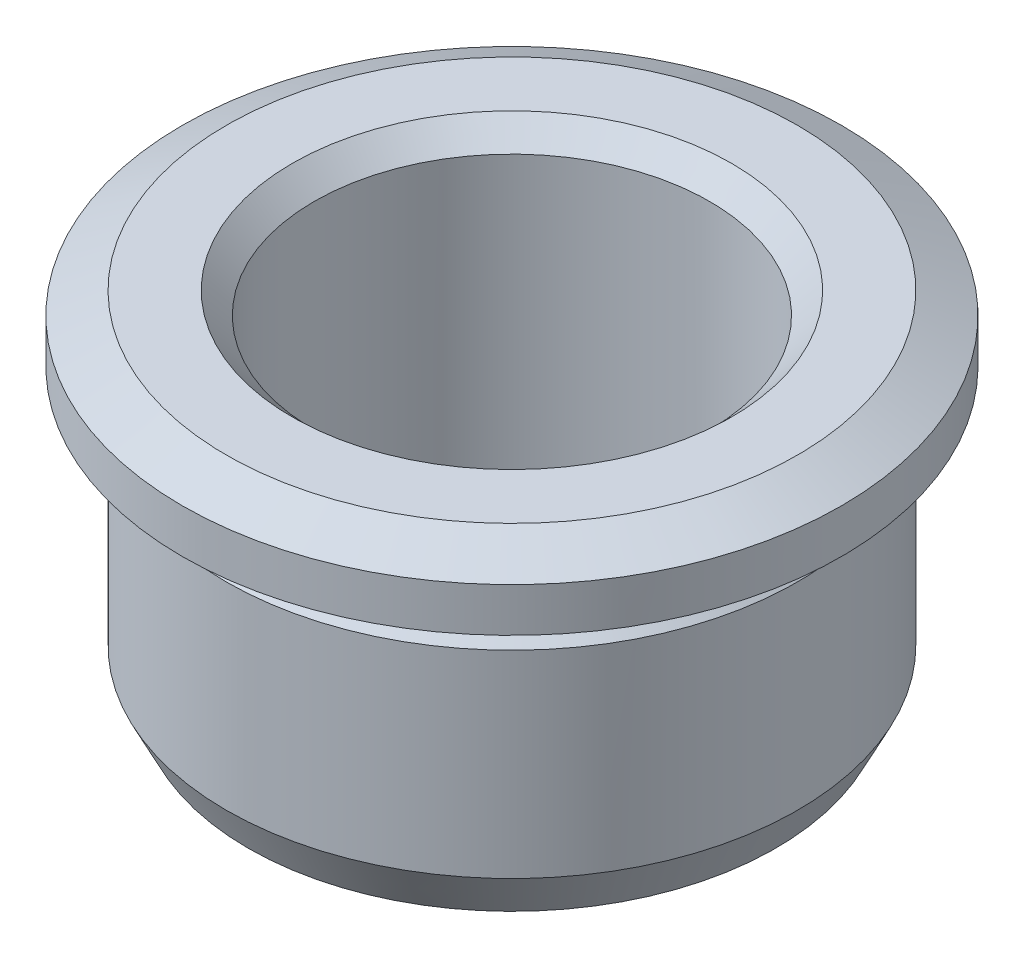
ISO-10303-21;
HEADER;
FILE_DESCRIPTION(('STEP AP214'),'2;1');
FILE_NAME('part.step','',(''),(''),'','','');
FILE_SCHEMA(('AUTOMOTIVE_DESIGN { 1 0 10303 214 1 1 1 1 }'));
ENDSEC;
DATA;
#1=APPLICATION_CONTEXT('core data for automotive mechanical design processes');
#2=APPLICATION_PROTOCOL_DEFINITION('international standard','automotive_design',2000,#1);
#3=PRODUCT_CONTEXT('',#1,'mechanical');
#4=PRODUCT('Part','Part','',(#3));
#5=PRODUCT_RELATED_PRODUCT_CATEGORY('part','',(#4));
#6=PRODUCT_DEFINITION_FORMATION('','',#4);
#7=PRODUCT_DEFINITION_CONTEXT('part definition',#1,'design');
#8=PRODUCT_DEFINITION('design','',#6,#7);
#9=PRODUCT_DEFINITION_SHAPE('','',#8);
#10=(LENGTH_UNIT() NAMED_UNIT(*) SI_UNIT(.MILLI.,.METRE.));
#11=(NAMED_UNIT(*) PLANE_ANGLE_UNIT() SI_UNIT($,.RADIAN.));
#12=(NAMED_UNIT(*) SI_UNIT($,.STERADIAN.) SOLID_ANGLE_UNIT());
#13=UNCERTAINTY_MEASURE_WITH_UNIT(LENGTH_MEASURE(1.E-05),#10,'distance_accuracy_value','');
#14=(GEOMETRIC_REPRESENTATION_CONTEXT(3) GLOBAL_UNCERTAINTY_ASSIGNED_CONTEXT((#13)) GLOBAL_UNIT_ASSIGNED_CONTEXT((#10,
#11,#12)) REPRESENTATION_CONTEXT('',''));
#15=CARTESIAN_POINT('',(0.,0.,0.));
#16=DIRECTION('',(0.,0.,1.));
#17=DIRECTION('',(1.,0.,0.));
#18=AXIS2_PLACEMENT_3D('',#15,#16,#17);
#19=CARTESIAN_POINT('',(0.,0.,0.));
#20=DIRECTION('',(0.,1.,0.));
#21=DIRECTION('',(0.,0.,1.));
#22=AXIS2_PLACEMENT_3D('',#19,#20,#21);
#23=PLANE('',#22);
#24=CARTESIAN_POINT('',(0.,0.,0.));
#25=DIRECTION('',(0.,1.,0.));
#26=DIRECTION('',(0.,0.,1.));
#27=AXIS2_PLACEMENT_3D('',#24,#25,#26);
#28=CIRCLE('',#27,10.);
#29=CARTESIAN_POINT('',(0.,0.,10.));
#30=VERTEX_POINT('',#29);
#31=EDGE_CURVE('E39',#30,#30,#28,.T.);
#32=ORIENTED_EDGE('',*,*,#31,.T.);
#33=EDGE_LOOP('',(#32));
#34=FACE_BOUND('',#33,.T.);
#35=CARTESIAN_POINT('',(0.,0.,0.));
#36=DIRECTION('',(0.,1.,0.));
#37=DIRECTION('',(0.,0.,1.));
#38=AXIS2_PLACEMENT_3D('',#35,#36,#37);
#39=CIRCLE('',#38,12.);
#40=CARTESIAN_POINT('',(0.,0.,12.));
#41=VERTEX_POINT('',#40);
#42=EDGE_CURVE('E61',#41,#41,#39,.F.);
#43=ORIENTED_EDGE('',*,*,#42,.T.);
#44=EDGE_LOOP('',(#43));
#45=FACE_BOUND('',#44,.T.);
#46=ADVANCED_FACE('F32',(#34,#45),#23,.F.);
#47=CARTESIAN_POINT('',(0.,16.,0.));
#48=DIRECTION('',(0.,1.,0.));
#49=DIRECTION('',(0.,0.,1.));
#50=AXIS2_PLACEMENT_3D('',#47,#48,#49);
#51=CYLINDRICAL_SURFACE('',#50,13.);
#52=CARTESIAN_POINT('',(0.,11.,0.));
#53=DIRECTION('',(0.,-1.,0.));
#54=DIRECTION('',(0.,0.,-1.));
#55=AXIS2_PLACEMENT_3D('',#52,#53,#54);
#56=CIRCLE('',#55,13.);
#57=CARTESIAN_POINT('',(0.,11.,-13.));
#58=VERTEX_POINT('',#57);
#59=EDGE_CURVE('E10',#58,#58,#56,.T.);
#60=ORIENTED_EDGE('',*,*,#59,.T.);
#61=EDGE_LOOP('',(#60));
#62=FACE_BOUND('',#61,.T.);
#63=CARTESIAN_POINT('',(0.,2.00000000000003,0.));
#64=DIRECTION('',(0.,1.,0.));
#65=DIRECTION('',(0.,0.,1.));
#66=AXIS2_PLACEMENT_3D('',#63,#64,#65);
#67=CIRCLE('',#66,13.);
#68=CARTESIAN_POINT('',(0.,2.00000000000003,13.));
#69=VERTEX_POINT('',#68);
#70=EDGE_CURVE('E64',#69,#69,#67,.T.);
#71=ORIENTED_EDGE('',*,*,#70,.T.);
#72=EDGE_LOOP('',(#71));
#73=FACE_BOUND('',#72,.T.);
#74=ADVANCED_FACE('F88',(#62,#73),#51,.T.);
#75=CARTESIAN_POINT('',(0.,16.,0.));
#76=DIRECTION('',(0.,1.,0.));
#77=DIRECTION('',(0.,0.,1.));
#78=AXIS2_PLACEMENT_3D('',#75,#76,#77);
#79=CYLINDRICAL_SURFACE('',#78,12.);
#80=CARTESIAN_POINT('',(0.,13.,0.));
#81=DIRECTION('',(0.,1.,0.));
#82=DIRECTION('',(0.,0.,1.));
#83=AXIS2_PLACEMENT_3D('',#80,#81,#82);
#84=CIRCLE('',#83,12.);
#85=CARTESIAN_POINT('',(0.,13.,12.));
#86=VERTEX_POINT('',#85);
#87=EDGE_CURVE('E70',#86,#86,#84,.T.);
#88=ORIENTED_EDGE('',*,*,#87,.F.);
#89=EDGE_LOOP('',(#88));
#90=FACE_BOUND('',#89,.T.);
#91=CARTESIAN_POINT('',(0.,12.,0.));
#92=DIRECTION('',(0.,1.,0.));
#93=DIRECTION('',(0.,0.,1.));
#94=AXIS2_PLACEMENT_3D('',#91,#92,#93);
#95=CIRCLE('',#94,12.);
#96=CARTESIAN_POINT('',(0.,12.,12.));
#97=VERTEX_POINT('',#96);
#98=EDGE_CURVE('E67',#97,#97,#95,.T.);
#99=ORIENTED_EDGE('',*,*,#98,.T.);
#100=EDGE_LOOP('',(#99));
#101=FACE_BOUND('',#100,.T.);
#102=ADVANCED_FACE('F82',(#90,#101),#79,.T.);
#103=CARTESIAN_POINT('',(12.,13.,0.));
#104=DIRECTION('',(0.,1.,0.));
#105=DIRECTION('',(0.,0.,1.));
#106=AXIS2_PLACEMENT_3D('',#103,#104,#105);
#107=PLANE('',#106);
#108=CARTESIAN_POINT('',(0.,13.,0.));
#109=DIRECTION('',(0.,1.,0.));
#110=DIRECTION('',(0.,0.,1.));
#111=AXIS2_PLACEMENT_3D('',#108,#109,#110);
#112=CIRCLE('',#111,15.);
#113=CARTESIAN_POINT('',(0.,13.,15.));
#114=VERTEX_POINT('',#113);
#115=EDGE_CURVE('E73',#114,#114,#112,.T.);
#116=ORIENTED_EDGE('',*,*,#115,.F.);
#117=EDGE_LOOP('',(#116));
#118=FACE_BOUND('',#117,.T.);
#119=ORIENTED_EDGE('',*,*,#87,.T.);
#120=EDGE_LOOP('',(#119));
#121=FACE_BOUND('',#120,.T.);
#122=ADVANCED_FACE('F79',(#118,#121),#107,.F.);
#123=CARTESIAN_POINT('',(0.,16.,0.));
#124=DIRECTION('',(0.,1.,0.));
#125=DIRECTION('',(0.,0.,1.));
#126=AXIS2_PLACEMENT_3D('',#123,#124,#125);
#127=CYLINDRICAL_SURFACE('',#126,15.);
#128=CARTESIAN_POINT('',(0.,15.,0.));
#129=DIRECTION('',(0.,-1.,0.));
#130=DIRECTION('',(0.,0.,-1.));
#131=AXIS2_PLACEMENT_3D('',#128,#129,#130);
#132=CIRCLE('',#131,15.);
#133=CARTESIAN_POINT('',(0.,15.,-15.));
#134=VERTEX_POINT('',#133);
#135=EDGE_CURVE('E55',#134,#134,#132,.T.);
#136=ORIENTED_EDGE('',*,*,#135,.T.);
#137=EDGE_LOOP('',(#136));
#138=FACE_BOUND('',#137,.T.);
#139=ORIENTED_EDGE('',*,*,#115,.T.);
#140=EDGE_LOOP('',(#139));
#141=FACE_BOUND('',#140,.T.);
#142=ADVANCED_FACE('F77',(#138,#141),#127,.T.);
#143=CARTESIAN_POINT('',(15.,16.,0.));
#144=DIRECTION('',(0.,-1.,0.));
#145=DIRECTION('',(0.,0.,-1.));
#146=AXIS2_PLACEMENT_3D('',#143,#144,#145);
#147=PLANE('',#146);
#148=CARTESIAN_POINT('',(0.,16.,0.));
#149=DIRECTION('',(0.,-1.,0.));
#150=DIRECTION('',(0.,0.,-1.));
#151=AXIS2_PLACEMENT_3D('',#148,#149,#150);
#152=CIRCLE('',#151,9.99999999999999);
#153=CARTESIAN_POINT('',(0.,16.,-9.99999999999999));
#154=VERTEX_POINT('',#153);
#155=EDGE_CURVE('E43',#154,#154,#152,.T.);
#156=ORIENTED_EDGE('',*,*,#155,.T.);
#157=EDGE_LOOP('',(#156));
#158=FACE_BOUND('',#157,.T.);
#159=CARTESIAN_POINT('',(0.,16.,0.));
#160=DIRECTION('',(0.,-1.,0.));
#161=DIRECTION('',(0.,0.,-1.));
#162=AXIS2_PLACEMENT_3D('',#159,#160,#161);
#163=CIRCLE('',#162,13.);
#164=CARTESIAN_POINT('',(0.,16.,-13.));
#165=VERTEX_POINT('',#164);
#166=EDGE_CURVE('E58',#165,#165,#163,.F.);
#167=ORIENTED_EDGE('',*,*,#166,.T.);
#168=EDGE_LOOP('',(#167));
#169=FACE_BOUND('',#168,.T.);
#170=ADVANCED_FACE('F127',(#158,#169),#147,.F.);
#171=CARTESIAN_POINT('',(0.,0.,0.));
#172=DIRECTION('',(0.,1.,0.));
#173=DIRECTION('',(-1.,0.,0.));
#174=AXIS2_PLACEMENT_3D('',#171,#172,#173);
#175=CYLINDRICAL_SURFACE('',#174,9.);
#176=CARTESIAN_POINT('',(0.,15.,0.));
#177=DIRECTION('',(0.,-1.,0.));
#178=DIRECTION('',(1.,0.,0.));
#179=AXIS2_PLACEMENT_3D('',#176,#177,#178);
#180=CIRCLE('',#179,9.);
#181=CARTESIAN_POINT('',(9.,15.,0.));
#182=VERTEX_POINT('',#181);
#183=EDGE_CURVE('E47',#182,#182,#180,.F.);
#184=ORIENTED_EDGE('',*,*,#183,.T.);
#185=EDGE_LOOP('',(#184));
#186=FACE_BOUND('',#185,.T.);
#187=CARTESIAN_POINT('',(0.,1.00000000000001,0.));
#188=DIRECTION('',(0.,1.,0.));
#189=DIRECTION('',(-1.,0.,0.));
#190=AXIS2_PLACEMENT_3D('',#187,#188,#189);
#191=CIRCLE('',#190,9.);
#192=CARTESIAN_POINT('',(-9.,1.00000000000001,0.));
#193=VERTEX_POINT('',#192);
#194=EDGE_CURVE('E52',#193,#193,#191,.F.);
#195=ORIENTED_EDGE('',*,*,#194,.T.);
#196=EDGE_LOOP('',(#195));
#197=FACE_BOUND('',#196,.T.);
#198=ADVANCED_FACE('F112',(#186,#197),#175,.F.);
#199=CARTESIAN_POINT('',(0.,2.00000000000003,0.));
#200=DIRECTION('',(0.,1.,0.));
#201=DIRECTION('',(0.,0.,1.));
#202=AXIS2_PLACEMENT_3D('',#199,#200,#201);
#203=CONICAL_SURFACE('',#202,13.,0.463647609000804);
#204=ORIENTED_EDGE('',*,*,#42,.F.);
#205=EDGE_LOOP('',(#204));
#206=FACE_BOUND('',#205,.T.);
#207=ORIENTED_EDGE('',*,*,#70,.F.);
#208=EDGE_LOOP('',(#207));
#209=FACE_BOUND('',#208,.T.);
#210=ADVANCED_FACE('F108',(#206,#209),#203,.T.);
#211=CARTESIAN_POINT('',(0.,16.,0.));
#212=DIRECTION('',(0.,-1.,0.));
#213=DIRECTION('',(0.,0.,-1.));
#214=AXIS2_PLACEMENT_3D('',#211,#212,#213);
#215=CONICAL_SURFACE('',#214,13.,1.10714871779409);
#216=ORIENTED_EDGE('',*,*,#135,.F.);
#217=EDGE_LOOP('',(#216));
#218=FACE_BOUND('',#217,.T.);
#219=ORIENTED_EDGE('',*,*,#166,.F.);
#220=EDGE_LOOP('',(#219));
#221=FACE_BOUND('',#220,.T.);
#222=ADVANCED_FACE('F111',(#218,#221),#215,.T.);
#223=CARTESIAN_POINT('',(0.,15.,0.));
#224=DIRECTION('',(0.,1.,0.));
#225=DIRECTION('',(-1.,0.,0.));
#226=AXIS2_PLACEMENT_3D('',#223,#224,#225);
#227=CONICAL_SURFACE('',#226,9.,0.78539816339745);
#228=ORIENTED_EDGE('',*,*,#155,.F.);
#229=EDGE_LOOP('',(#228));
#230=FACE_BOUND('',#229,.T.);
#231=ORIENTED_EDGE('',*,*,#183,.F.);
#232=EDGE_LOOP('',(#231));
#233=FACE_BOUND('',#232,.T.);
#234=ADVANCED_FACE('F98',(#230,#233),#227,.F.);
#235=CARTESIAN_POINT('',(0.,0.,0.));
#236=DIRECTION('',(0.,-1.,0.));
#237=DIRECTION('',(1.,0.,0.));
#238=AXIS2_PLACEMENT_3D('',#235,#236,#237);
#239=CONICAL_SURFACE('',#238,10.,0.785398163397448);
#240=ORIENTED_EDGE('',*,*,#194,.F.);
#241=EDGE_LOOP('',(#240));
#242=FACE_BOUND('',#241,.T.);
#243=ORIENTED_EDGE('',*,*,#31,.F.);
#244=EDGE_LOOP('',(#243));
#245=FACE_BOUND('',#244,.T.);
#246=ADVANCED_FACE('F93',(#242,#245),#239,.F.);
#247=CARTESIAN_POINT('',(0.,12.,0.));
#248=DIRECTION('',(0.,-1.,0.));
#249=DIRECTION('',(0.,0.,-1.));
#250=AXIS2_PLACEMENT_3D('',#247,#248,#249);
#251=CONICAL_SURFACE('',#250,12.,0.785398163397447);
#252=ORIENTED_EDGE('',*,*,#59,.F.);
#253=EDGE_LOOP('',(#252));
#254=FACE_BOUND('',#253,.T.);
#255=ORIENTED_EDGE('',*,*,#98,.F.);
#256=EDGE_LOOP('',(#255));
#257=FACE_BOUND('',#256,.T.);
#258=ADVANCED_FACE('F34',(#254,#257),#251,.T.);
#259=CLOSED_SHELL('',(#46,#74,#102,#122,#142,#170,#198,#210,#222,#234,#246,#258));
#260=MANIFOLD_SOLID_BREP('B2',#259);
#261=ADVANCED_BREP_SHAPE_REPRESENTATION('',(#18,#260),#14);
#262=SHAPE_DEFINITION_REPRESENTATION(#9,#261);
ENDSEC;
END-ISO-10303-21;
